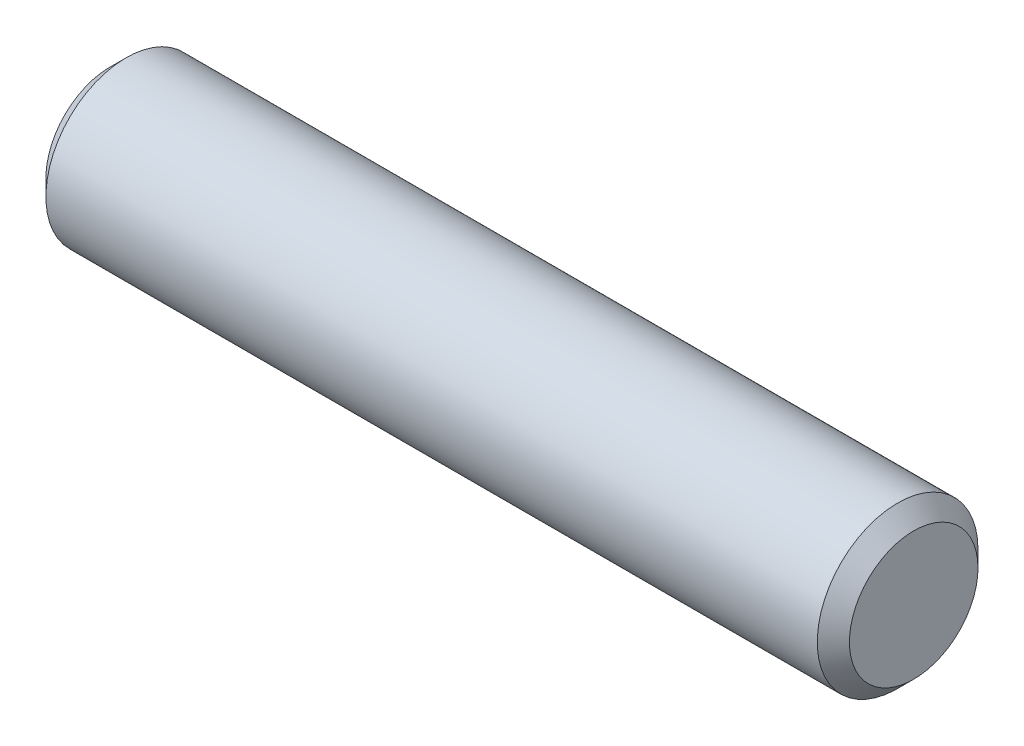
ISO-10303-21;
HEADER;
FILE_DESCRIPTION(('STEP AP214'),'2;1');
FILE_NAME('part.step','',(''),(''),'','','');
FILE_SCHEMA(('AUTOMOTIVE_DESIGN { 1 0 10303 214 1 1 1 1 }'));
ENDSEC;
DATA;
#1=APPLICATION_CONTEXT('core data for automotive mechanical design processes');
#2=APPLICATION_PROTOCOL_DEFINITION('international standard','automotive_design',2000,#1);
#3=PRODUCT_CONTEXT('',#1,'mechanical');
#4=PRODUCT('Part','Part','',(#3));
#5=PRODUCT_RELATED_PRODUCT_CATEGORY('part','',(#4));
#6=PRODUCT_DEFINITION_FORMATION('','',#4);
#7=PRODUCT_DEFINITION_CONTEXT('part definition',#1,'design');
#8=PRODUCT_DEFINITION('design','',#6,#7);
#9=PRODUCT_DEFINITION_SHAPE('','',#8);
#10=(LENGTH_UNIT() NAMED_UNIT(*) SI_UNIT(.MILLI.,.METRE.));
#11=(NAMED_UNIT(*) PLANE_ANGLE_UNIT() SI_UNIT($,.RADIAN.));
#12=(NAMED_UNIT(*) SI_UNIT($,.STERADIAN.) SOLID_ANGLE_UNIT());
#13=UNCERTAINTY_MEASURE_WITH_UNIT(LENGTH_MEASURE(1.E-05),#10,'distance_accuracy_value','');
#14=(GEOMETRIC_REPRESENTATION_CONTEXT(3) GLOBAL_UNCERTAINTY_ASSIGNED_CONTEXT((#13)) GLOBAL_UNIT_ASSIGNED_CONTEXT((#10,
#11,#12)) REPRESENTATION_CONTEXT('',''));
#15=CARTESIAN_POINT('',(0.,0.,0.));
#16=DIRECTION('',(0.,0.,1.));
#17=DIRECTION('',(1.,0.,0.));
#18=AXIS2_PLACEMENT_3D('',#15,#16,#17);
#19=CARTESIAN_POINT('',(-7.9375,0.,0.));
#20=DIRECTION('',(1.,0.,0.));
#21=DIRECTION('',(0.,0.,-1.));
#22=AXIS2_PLACEMENT_3D('',#19,#20,#21);
#23=CYLINDRICAL_SURFACE('',#22,1.5875);
#24=CARTESIAN_POINT('',(7.62,0.,0.));
#25=DIRECTION('',(1.,0.,0.));
#26=DIRECTION('',(0.,0.,-1.));
#27=AXIS2_PLACEMENT_3D('',#24,#25,#26);
#28=CIRCLE('',#27,1.5875);
#29=CARTESIAN_POINT('',(7.62,0.,-1.5875));
#30=VERTEX_POINT('',#29);
#31=EDGE_CURVE('E44',#30,#30,#28,.F.);
#32=ORIENTED_EDGE('',*,*,#31,.T.);
#33=EDGE_LOOP('',(#32));
#34=FACE_BOUND('',#33,.T.);
#35=CARTESIAN_POINT('',(-7.62,0.,0.));
#36=DIRECTION('',(1.,0.,0.));
#37=DIRECTION('',(0.,0.,-1.));
#38=AXIS2_PLACEMENT_3D('',#35,#36,#37);
#39=CIRCLE('',#38,1.5875);
#40=CARTESIAN_POINT('',(-7.62,0.,-1.5875));
#41=VERTEX_POINT('',#40);
#42=EDGE_CURVE('E50',#41,#41,#39,.T.);
#43=ORIENTED_EDGE('',*,*,#42,.T.);
#44=EDGE_LOOP('',(#43));
#45=FACE_BOUND('',#44,.T.);
#46=ADVANCED_FACE('F36',(#34,#45),#23,.T.);
#47=CARTESIAN_POINT('',(-7.9375,0.,0.));
#48=DIRECTION('',(1.,0.,0.));
#49=DIRECTION('',(0.,0.,-1.));
#50=AXIS2_PLACEMENT_3D('',#47,#48,#49);
#51=PLANE('',#50);
#52=CARTESIAN_POINT('',(-7.9375,0.,0.));
#53=DIRECTION('',(1.,0.,0.));
#54=DIRECTION('',(0.,0.,-1.));
#55=AXIS2_PLACEMENT_3D('',#52,#53,#54);
#56=CIRCLE('',#55,1.27);
#57=CARTESIAN_POINT('',(-7.9375,0.,-1.27));
#58=VERTEX_POINT('',#57);
#59=EDGE_CURVE('E10',#58,#58,#56,.F.);
#60=ORIENTED_EDGE('',*,*,#59,.T.);
#61=EDGE_LOOP('',(#60));
#62=FACE_BOUND('',#61,.T.);
#63=ADVANCED_FACE('F71',(#62),#51,.F.);
#64=CARTESIAN_POINT('',(7.9375,0.,0.));
#65=DIRECTION('',(1.,0.,0.));
#66=DIRECTION('',(0.,0.,-1.));
#67=AXIS2_PLACEMENT_3D('',#64,#65,#66);
#68=PLANE('',#67);
#69=CARTESIAN_POINT('',(7.9375,0.,0.));
#70=DIRECTION('',(1.,0.,0.));
#71=DIRECTION('',(0.,0.,-1.));
#72=AXIS2_PLACEMENT_3D('',#69,#70,#71);
#73=CIRCLE('',#72,1.27);
#74=CARTESIAN_POINT('',(7.9375,0.,-1.27));
#75=VERTEX_POINT('',#74);
#76=EDGE_CURVE('E55',#75,#75,#73,.T.);
#77=ORIENTED_EDGE('',*,*,#76,.T.);
#78=EDGE_LOOP('',(#77));
#79=FACE_BOUND('',#78,.T.);
#80=ADVANCED_FACE('F61',(#79),#68,.T.);
#81=CARTESIAN_POINT('',(7.9375,0.,0.));
#82=DIRECTION('',(-1.,0.,0.));
#83=DIRECTION('',(0.,0.,1.));
#84=AXIS2_PLACEMENT_3D('',#81,#82,#83);
#85=CONICAL_SURFACE('',#84,1.27,0.785398163397445);
#86=ORIENTED_EDGE('',*,*,#31,.F.);
#87=EDGE_LOOP('',(#86));
#88=FACE_BOUND('',#87,.T.);
#89=ORIENTED_EDGE('',*,*,#76,.F.);
#90=EDGE_LOOP('',(#89));
#91=FACE_BOUND('',#90,.T.);
#92=ADVANCED_FACE('F63',(#88,#91),#85,.T.);
#93=CARTESIAN_POINT('',(-7.62,0.,0.));
#94=DIRECTION('',(1.,0.,0.));
#95=DIRECTION('',(0.,0.,-1.));
#96=AXIS2_PLACEMENT_3D('',#93,#94,#95);
#97=CONICAL_SURFACE('',#96,1.5875,0.78539816339745);
#98=ORIENTED_EDGE('',*,*,#59,.F.);
#99=EDGE_LOOP('',(#98));
#100=FACE_BOUND('',#99,.T.);
#101=ORIENTED_EDGE('',*,*,#42,.F.);
#102=EDGE_LOOP('',(#101));
#103=FACE_BOUND('',#102,.T.);
#104=ADVANCED_FACE('F38',(#100,#103),#97,.T.);
#105=CLOSED_SHELL('',(#46,#63,#80,#92,#104));
#106=MANIFOLD_SOLID_BREP('B2',#105);
#107=ADVANCED_BREP_SHAPE_REPRESENTATION('',(#18,#106),#14);
#108=SHAPE_DEFINITION_REPRESENTATION(#9,#107);
ENDSEC;
END-ISO-10303-21;
